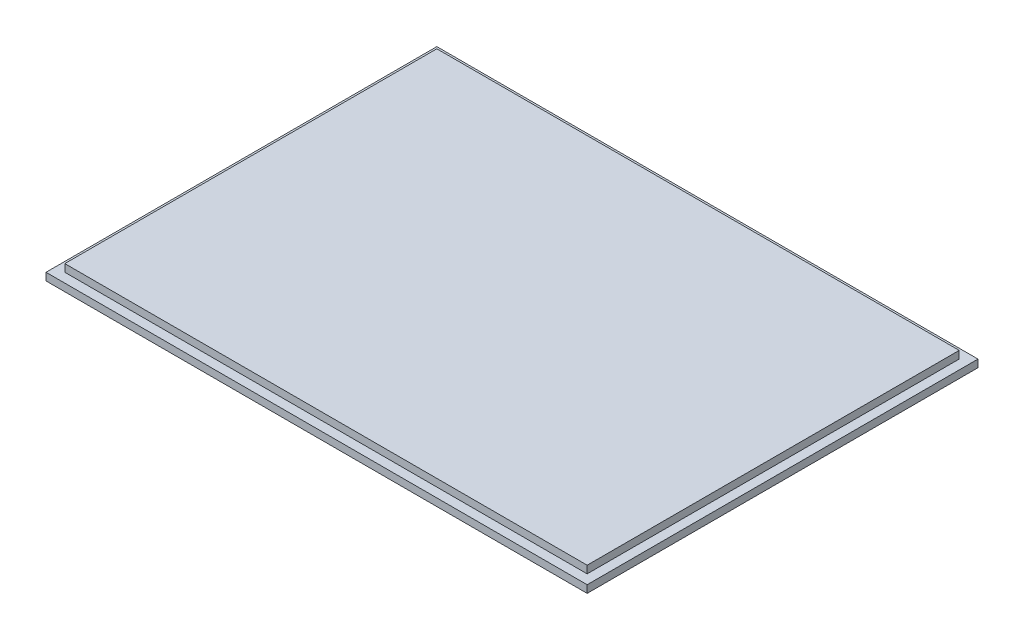
ISO-10303-21;
HEADER;
FILE_DESCRIPTION(('STEP AP214'),'2;1');
FILE_NAME('part.step','',(''),(''),'','','');
FILE_SCHEMA(('AUTOMOTIVE_DESIGN { 1 0 10303 214 1 1 1 1 }'));
ENDSEC;
DATA;
#1=APPLICATION_CONTEXT('core data for automotive mechanical design processes');
#2=APPLICATION_PROTOCOL_DEFINITION('international standard','automotive_design',2000,#1);
#3=PRODUCT_CONTEXT('',#1,'mechanical');
#4=PRODUCT('Part','Part','',(#3));
#5=PRODUCT_RELATED_PRODUCT_CATEGORY('part','',(#4));
#6=PRODUCT_DEFINITION_FORMATION('','',#4);
#7=PRODUCT_DEFINITION_CONTEXT('part definition',#1,'design');
#8=PRODUCT_DEFINITION('design','',#6,#7);
#9=PRODUCT_DEFINITION_SHAPE('','',#8);
#10=(LENGTH_UNIT() NAMED_UNIT(*) SI_UNIT(.MILLI.,.METRE.));
#11=(NAMED_UNIT(*) PLANE_ANGLE_UNIT() SI_UNIT($,.RADIAN.));
#12=(NAMED_UNIT(*) SI_UNIT($,.STERADIAN.) SOLID_ANGLE_UNIT());
#13=UNCERTAINTY_MEASURE_WITH_UNIT(LENGTH_MEASURE(1.E-05),#10,'distance_accuracy_value','');
#14=(GEOMETRIC_REPRESENTATION_CONTEXT(3) GLOBAL_UNCERTAINTY_ASSIGNED_CONTEXT((#13)) GLOBAL_UNIT_ASSIGNED_CONTEXT((#10,
#11,#12)) REPRESENTATION_CONTEXT('',''));
#15=CARTESIAN_POINT('',(0.,0.,0.));
#16=DIRECTION('',(0.,0.,1.));
#17=DIRECTION('',(1.,0.,0.));
#18=AXIS2_PLACEMENT_3D('',#15,#16,#17);
#19=CARTESIAN_POINT('',(-1.25,1.,1.25));
#20=DIRECTION('',(0.,0.,-1.));
#21=DIRECTION('',(-1.,0.,0.));
#22=AXIS2_PLACEMENT_3D('',#19,#20,#21);
#23=PLANE('',#22);
#24=DIRECTION('',(1.,0.,0.));
#25=VECTOR('',#24,1.);
#26=CARTESIAN_POINT('',(-1.25,0.,1.25));
#27=LINE('',#26,#25);
#28=CARTESIAN_POINT('',(-1.25,0.,1.25));
#29=VERTEX_POINT('',#28);
#30=CARTESIAN_POINT('',(70.75,0.,1.25));
#31=VERTEX_POINT('',#30);
#32=EDGE_CURVE('E171',#29,#31,#27,.T.);
#33=ORIENTED_EDGE('',*,*,#32,.T.);
#34=DIRECTION('',(0.,-1.,0.));
#35=VECTOR('',#34,1.);
#36=CARTESIAN_POINT('',(70.75,1.,1.25));
#37=LINE('',#36,#35);
#38=CARTESIAN_POINT('',(70.75,1.,1.25));
#39=VERTEX_POINT('',#38);
#40=EDGE_CURVE('E12',#39,#31,#37,.T.);
#41=ORIENTED_EDGE('',*,*,#40,.F.);
#42=DIRECTION('',(1.,0.,0.));
#43=VECTOR('',#42,1.);
#44=CARTESIAN_POINT('',(-1.25,1.,1.25));
#45=LINE('',#44,#43);
#46=CARTESIAN_POINT('',(-1.25,1.,1.25));
#47=VERTEX_POINT('',#46);
#48=EDGE_CURVE('E172',#47,#39,#45,.T.);
#49=ORIENTED_EDGE('',*,*,#48,.F.);
#50=DIRECTION('',(0.,-1.,0.));
#51=VECTOR('',#50,1.);
#52=CARTESIAN_POINT('',(-1.25,1.,1.25));
#53=LINE('',#52,#51);
#54=EDGE_CURVE('E78',#47,#29,#53,.T.);
#55=ORIENTED_EDGE('',*,*,#54,.T.);
#56=EDGE_LOOP('',(#33,#41,#49,#55));
#57=FACE_BOUND('',#56,.T.);
#58=ADVANCED_FACE('F62',(#57),#23,.F.);
#59=CARTESIAN_POINT('',(70.75,1.,1.25));
#60=DIRECTION('',(-1.,0.,0.));
#61=DIRECTION('',(0.,0.,1.));
#62=AXIS2_PLACEMENT_3D('',#59,#60,#61);
#63=PLANE('',#62);
#64=DIRECTION('',(0.,0.,-1.));
#65=VECTOR('',#64,1.);
#66=CARTESIAN_POINT('',(70.75,0.,1.25));
#67=LINE('',#66,#65);
#68=CARTESIAN_POINT('',(70.75,0.,-50.75));
#69=VERTEX_POINT('',#68);
#70=EDGE_CURVE('E182',#31,#69,#67,.T.);
#71=ORIENTED_EDGE('',*,*,#70,.T.);
#72=DIRECTION('',(0.,-1.,0.));
#73=VECTOR('',#72,1.);
#74=CARTESIAN_POINT('',(70.75,1.,-50.75));
#75=LINE('',#74,#73);
#76=CARTESIAN_POINT('',(70.75,1.,-50.75));
#77=VERTEX_POINT('',#76);
#78=EDGE_CURVE('E70',#77,#69,#75,.T.);
#79=ORIENTED_EDGE('',*,*,#78,.F.);
#80=DIRECTION('',(0.,0.,-1.));
#81=VECTOR('',#80,1.);
#82=CARTESIAN_POINT('',(70.75,1.,1.25));
#83=LINE('',#82,#81);
#84=EDGE_CURVE('E104',#39,#77,#83,.T.);
#85=ORIENTED_EDGE('',*,*,#84,.F.);
#86=ORIENTED_EDGE('',*,*,#40,.T.);
#87=EDGE_LOOP('',(#71,#79,#85,#86));
#88=FACE_BOUND('',#87,.T.);
#89=ADVANCED_FACE('F194',(#88),#63,.F.);
#90=CARTESIAN_POINT('',(-1.25,1.,-50.75));
#91=DIRECTION('',(0.,0.,-1.));
#92=DIRECTION('',(-1.,0.,0.));
#93=AXIS2_PLACEMENT_3D('',#90,#91,#92);
#94=PLANE('',#93);
#95=DIRECTION('',(1.,0.,0.));
#96=VECTOR('',#95,1.);
#97=CARTESIAN_POINT('',(-1.25,0.,-50.75));
#98=LINE('',#97,#96);
#99=CARTESIAN_POINT('',(-1.25,0.,-50.75));
#100=VERTEX_POINT('',#99);
#101=EDGE_CURVE('E185',#100,#69,#98,.T.);
#102=ORIENTED_EDGE('',*,*,#101,.F.);
#103=DIRECTION('',(0.,-1.,0.));
#104=VECTOR('',#103,1.);
#105=CARTESIAN_POINT('',(-1.25,1.,-50.75));
#106=LINE('',#105,#104);
#107=CARTESIAN_POINT('',(-1.25,1.,-50.75));
#108=VERTEX_POINT('',#107);
#109=EDGE_CURVE('E93',#108,#100,#106,.T.);
#110=ORIENTED_EDGE('',*,*,#109,.F.);
#111=DIRECTION('',(1.,0.,0.));
#112=VECTOR('',#111,1.);
#113=CARTESIAN_POINT('',(-1.25,1.,-50.75));
#114=LINE('',#113,#112);
#115=EDGE_CURVE('E176',#108,#77,#114,.T.);
#116=ORIENTED_EDGE('',*,*,#115,.T.);
#117=ORIENTED_EDGE('',*,*,#78,.T.);
#118=EDGE_LOOP('',(#102,#110,#116,#117));
#119=FACE_BOUND('',#118,.T.);
#120=ADVANCED_FACE('F192',(#119),#94,.T.);
#121=CARTESIAN_POINT('',(-1.25,1.,1.25));
#122=DIRECTION('',(-1.,0.,0.));
#123=DIRECTION('',(0.,0.,1.));
#124=AXIS2_PLACEMENT_3D('',#121,#122,#123);
#125=PLANE('',#124);
#126=DIRECTION('',(0.,0.,-1.));
#127=VECTOR('',#126,1.);
#128=CARTESIAN_POINT('',(-1.25,0.,1.25));
#129=LINE('',#128,#127);
#130=EDGE_CURVE('E174',#29,#100,#129,.T.);
#131=ORIENTED_EDGE('',*,*,#130,.F.);
#132=ORIENTED_EDGE('',*,*,#54,.F.);
#133=DIRECTION('',(0.,0.,-1.));
#134=VECTOR('',#133,1.);
#135=CARTESIAN_POINT('',(-1.25,1.,1.25));
#136=LINE('',#135,#134);
#137=EDGE_CURVE('E179',#47,#108,#136,.T.);
#138=ORIENTED_EDGE('',*,*,#137,.T.);
#139=ORIENTED_EDGE('',*,*,#109,.T.);
#140=EDGE_LOOP('',(#131,#132,#138,#139));
#141=FACE_BOUND('',#140,.T.);
#142=ADVANCED_FACE('F198',(#141),#125,.T.);
#143=CARTESIAN_POINT('',(0.,1.,0.));
#144=DIRECTION('',(0.,1.,0.));
#145=DIRECTION('',(0.,0.,1.));
#146=AXIS2_PLACEMENT_3D('',#143,#144,#145);
#147=PLANE('',#146);
#148=DIRECTION('',(1.,0.,0.));
#149=VECTOR('',#148,1.);
#150=CARTESIAN_POINT('',(0.,1.,-49.5));
#151=LINE('',#150,#149);
#152=CARTESIAN_POINT('',(0.,1.,-49.5));
#153=VERTEX_POINT('',#152);
#154=CARTESIAN_POINT('',(69.5,1.,-49.5));
#155=VERTEX_POINT('',#154);
#156=EDGE_CURVE('E157',#153,#155,#151,.T.);
#157=ORIENTED_EDGE('',*,*,#156,.T.);
#158=DIRECTION('',(0.,0.,-1.));
#159=VECTOR('',#158,1.);
#160=CARTESIAN_POINT('',(69.5,1.,0.));
#161=LINE('',#160,#159);
#162=CARTESIAN_POINT('',(69.5,1.,0.));
#163=VERTEX_POINT('',#162);
#164=EDGE_CURVE('E160',#163,#155,#161,.T.);
#165=ORIENTED_EDGE('',*,*,#164,.F.);
#166=DIRECTION('',(1.,0.,0.));
#167=VECTOR('',#166,1.);
#168=CARTESIAN_POINT('',(0.,1.,0.));
#169=LINE('',#168,#167);
#170=CARTESIAN_POINT('',(0.,1.,0.));
#171=VERTEX_POINT('',#170);
#172=EDGE_CURVE('E156',#171,#163,#169,.T.);
#173=ORIENTED_EDGE('',*,*,#172,.F.);
#174=DIRECTION('',(0.,0.,-1.));
#175=VECTOR('',#174,1.);
#176=CARTESIAN_POINT('',(0.,1.,0.));
#177=LINE('',#176,#175);
#178=EDGE_CURVE('E168',#171,#153,#177,.T.);
#179=ORIENTED_EDGE('',*,*,#178,.T.);
#180=EDGE_LOOP('',(#157,#165,#173,#179));
#181=FACE_BOUND('',#180,.T.);
#182=ORIENTED_EDGE('',*,*,#48,.T.);
#183=ORIENTED_EDGE('',*,*,#84,.T.);
#184=ORIENTED_EDGE('',*,*,#115,.F.);
#185=ORIENTED_EDGE('',*,*,#137,.F.);
#186=EDGE_LOOP('',(#182,#183,#184,#185));
#187=FACE_BOUND('',#186,.T.);
#188=ADVANCED_FACE('F200',(#181,#187),#147,.T.);
#189=CARTESIAN_POINT('',(0.,0.,0.));
#190=DIRECTION('',(0.,1.,0.));
#191=DIRECTION('',(0.,0.,1.));
#192=AXIS2_PLACEMENT_3D('',#189,#190,#191);
#193=PLANE('',#192);
#194=ORIENTED_EDGE('',*,*,#32,.F.);
#195=ORIENTED_EDGE('',*,*,#130,.T.);
#196=ORIENTED_EDGE('',*,*,#101,.T.);
#197=ORIENTED_EDGE('',*,*,#70,.F.);
#198=EDGE_LOOP('',(#194,#195,#196,#197));
#199=FACE_BOUND('',#198,.T.);
#200=ADVANCED_FACE('F197',(#199),#193,.F.);
#201=CARTESIAN_POINT('',(0.,2.,0.));
#202=DIRECTION('',(0.,0.,-1.));
#203=DIRECTION('',(-1.,0.,0.));
#204=AXIS2_PLACEMENT_3D('',#201,#202,#203);
#205=PLANE('',#204);
#206=ORIENTED_EDGE('',*,*,#172,.T.);
#207=DIRECTION('',(0.,-1.,0.));
#208=VECTOR('',#207,1.);
#209=CARTESIAN_POINT('',(69.5,2.,0.));
#210=LINE('',#209,#208);
#211=CARTESIAN_POINT('',(69.5,2.,0.));
#212=VERTEX_POINT('',#211);
#213=EDGE_CURVE('E136',#212,#163,#210,.T.);
#214=ORIENTED_EDGE('',*,*,#213,.F.);
#215=DIRECTION('',(1.,0.,0.));
#216=VECTOR('',#215,1.);
#217=CARTESIAN_POINT('',(0.,2.,0.));
#218=LINE('',#217,#216);
#219=CARTESIAN_POINT('',(0.,2.,0.));
#220=VERTEX_POINT('',#219);
#221=EDGE_CURVE('E144',#220,#212,#218,.T.);
#222=ORIENTED_EDGE('',*,*,#221,.F.);
#223=DIRECTION('',(0.,-1.,0.));
#224=VECTOR('',#223,1.);
#225=CARTESIAN_POINT('',(0.,2.,0.));
#226=LINE('',#225,#224);
#227=EDGE_CURVE('E289',#220,#171,#226,.T.);
#228=ORIENTED_EDGE('',*,*,#227,.T.);
#229=EDGE_LOOP('',(#206,#214,#222,#228));
#230=FACE_BOUND('',#229,.T.);
#231=ADVANCED_FACE('F154',(#230),#205,.F.);
#232=CARTESIAN_POINT('',(69.5,2.,0.));
#233=DIRECTION('',(-1.,0.,0.));
#234=DIRECTION('',(0.,0.,1.));
#235=AXIS2_PLACEMENT_3D('',#232,#233,#234);
#236=PLANE('',#235);
#237=ORIENTED_EDGE('',*,*,#164,.T.);
#238=DIRECTION('',(0.,-1.,0.));
#239=VECTOR('',#238,1.);
#240=CARTESIAN_POINT('',(69.5,2.,-49.5));
#241=LINE('',#240,#239);
#242=CARTESIAN_POINT('',(69.5,2.,-49.5));
#243=VERTEX_POINT('',#242);
#244=EDGE_CURVE('E139',#243,#155,#241,.T.);
#245=ORIENTED_EDGE('',*,*,#244,.F.);
#246=DIRECTION('',(0.,0.,-1.));
#247=VECTOR('',#246,1.);
#248=CARTESIAN_POINT('',(69.5,2.,0.));
#249=LINE('',#248,#247);
#250=EDGE_CURVE('E132',#212,#243,#249,.T.);
#251=ORIENTED_EDGE('',*,*,#250,.F.);
#252=ORIENTED_EDGE('',*,*,#213,.T.);
#253=EDGE_LOOP('',(#237,#245,#251,#252));
#254=FACE_BOUND('',#253,.T.);
#255=ADVANCED_FACE('F134',(#254),#236,.F.);
#256=CARTESIAN_POINT('',(0.,2.,-49.5));
#257=DIRECTION('',(0.,0.,-1.));
#258=DIRECTION('',(-1.,0.,0.));
#259=AXIS2_PLACEMENT_3D('',#256,#257,#258);
#260=PLANE('',#259);
#261=ORIENTED_EDGE('',*,*,#244,.T.);
#262=ORIENTED_EDGE('',*,*,#156,.F.);
#263=DIRECTION('',(0.,-1.,0.));
#264=VECTOR('',#263,1.);
#265=CARTESIAN_POINT('',(0.,2.,-49.5));
#266=LINE('',#265,#264);
#267=CARTESIAN_POINT('',(0.,2.,-49.5));
#268=VERTEX_POINT('',#267);
#269=EDGE_CURVE('E162',#268,#153,#266,.T.);
#270=ORIENTED_EDGE('',*,*,#269,.F.);
#271=DIRECTION('',(1.,0.,0.));
#272=VECTOR('',#271,1.);
#273=CARTESIAN_POINT('',(0.,2.,-49.5));
#274=LINE('',#273,#272);
#275=EDGE_CURVE('E143',#268,#243,#274,.T.);
#276=ORIENTED_EDGE('',*,*,#275,.T.);
#277=EDGE_LOOP('',(#261,#262,#270,#276));
#278=FACE_BOUND('',#277,.T.);
#279=ADVANCED_FACE('F257',(#278),#260,.T.);
#280=CARTESIAN_POINT('',(0.,2.,0.));
#281=DIRECTION('',(-1.,0.,0.));
#282=DIRECTION('',(0.,0.,1.));
#283=AXIS2_PLACEMENT_3D('',#280,#281,#282);
#284=PLANE('',#283);
#285=ORIENTED_EDGE('',*,*,#269,.T.);
#286=ORIENTED_EDGE('',*,*,#178,.F.);
#287=ORIENTED_EDGE('',*,*,#227,.F.);
#288=DIRECTION('',(0.,0.,-1.));
#289=VECTOR('',#288,1.);
#290=CARTESIAN_POINT('',(0.,2.,0.));
#291=LINE('',#290,#289);
#292=EDGE_CURVE('E150',#220,#268,#291,.T.);
#293=ORIENTED_EDGE('',*,*,#292,.T.);
#294=EDGE_LOOP('',(#285,#286,#287,#293));
#295=FACE_BOUND('',#294,.T.);
#296=ADVANCED_FACE('F266',(#295),#284,.T.);
#297=CARTESIAN_POINT('',(0.,2.,0.));
#298=DIRECTION('',(0.,1.,0.));
#299=DIRECTION('',(0.,0.,1.));
#300=AXIS2_PLACEMENT_3D('',#297,#298,#299);
#301=PLANE('',#300);
#302=ORIENTED_EDGE('',*,*,#221,.T.);
#303=ORIENTED_EDGE('',*,*,#250,.T.);
#304=ORIENTED_EDGE('',*,*,#275,.F.);
#305=ORIENTED_EDGE('',*,*,#292,.F.);
#306=EDGE_LOOP('',(#302,#303,#304,#305));
#307=FACE_BOUND('',#306,.T.);
#308=ADVANCED_FACE('F148',(#307),#301,.T.);
#309=CLOSED_SHELL('',(#58,#89,#120,#142,#188,#200,#231,#255,#279,#296,#308));
#310=MANIFOLD_SOLID_BREP('B2',#309);
#311=ADVANCED_BREP_SHAPE_REPRESENTATION('',(#18,#310),#14);
#312=SHAPE_DEFINITION_REPRESENTATION(#9,#311);
ENDSEC;
END-ISO-10303-21;
